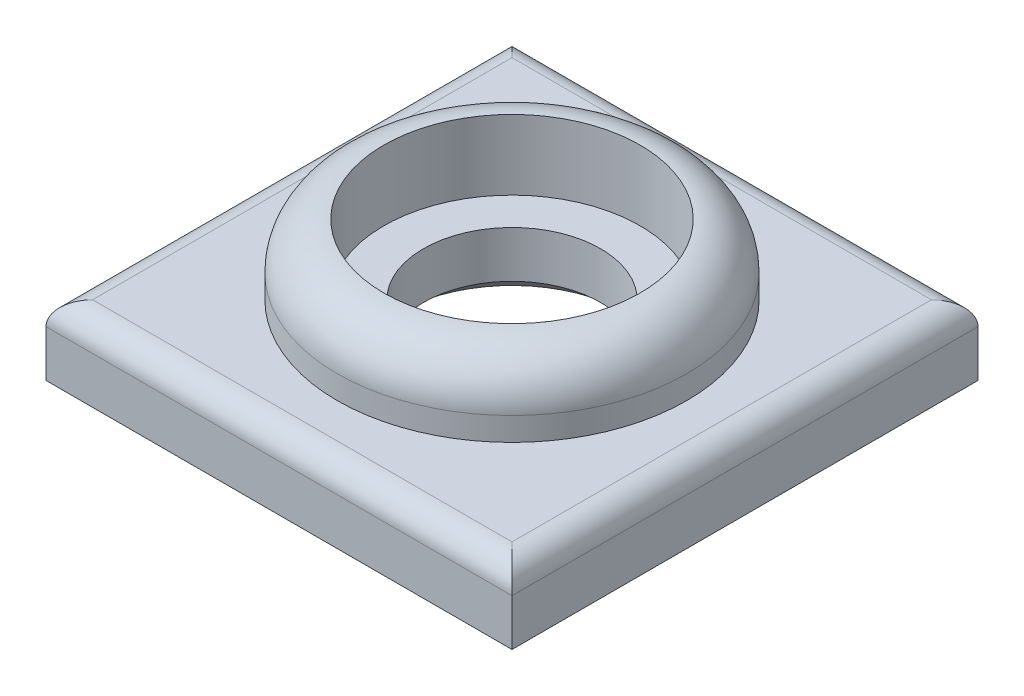
ISO-10303-21;
HEADER;
FILE_DESCRIPTION(('STEP AP214'),'2;1');
FILE_NAME('part.step','',(''),(''),'','','');
FILE_SCHEMA(('AUTOMOTIVE_DESIGN { 1 0 10303 214 1 1 1 1 }'));
ENDSEC;
DATA;
#1=APPLICATION_CONTEXT('core data for automotive mechanical design processes');
#2=APPLICATION_PROTOCOL_DEFINITION('international standard','automotive_design',2000,#1);
#3=PRODUCT_CONTEXT('',#1,'mechanical');
#4=PRODUCT('Part','Part','',(#3));
#5=PRODUCT_RELATED_PRODUCT_CATEGORY('part','',(#4));
#6=PRODUCT_DEFINITION_FORMATION('','',#4);
#7=PRODUCT_DEFINITION_CONTEXT('part definition',#1,'design');
#8=PRODUCT_DEFINITION('design','',#6,#7);
#9=PRODUCT_DEFINITION_SHAPE('','',#8);
#10=(LENGTH_UNIT() NAMED_UNIT(*) SI_UNIT(.MILLI.,.METRE.));
#11=(NAMED_UNIT(*) PLANE_ANGLE_UNIT() SI_UNIT($,.RADIAN.));
#12=(NAMED_UNIT(*) SI_UNIT($,.STERADIAN.) SOLID_ANGLE_UNIT());
#13=UNCERTAINTY_MEASURE_WITH_UNIT(LENGTH_MEASURE(1.E-05),#10,'distance_accuracy_value','');
#14=(GEOMETRIC_REPRESENTATION_CONTEXT(3) GLOBAL_UNCERTAINTY_ASSIGNED_CONTEXT((#13)) GLOBAL_UNIT_ASSIGNED_CONTEXT((#10,
#11,#12)) REPRESENTATION_CONTEXT('',''));
#15=CARTESIAN_POINT('',(0.,0.,0.));
#16=DIRECTION('',(0.,0.,1.));
#17=DIRECTION('',(1.,0.,0.));
#18=AXIS2_PLACEMENT_3D('',#15,#16,#17);
#19=CARTESIAN_POINT('',(0.,3.,0.));
#20=DIRECTION('',(0.,1.,0.));
#21=DIRECTION('',(0.,0.,1.));
#22=AXIS2_PLACEMENT_3D('',#19,#20,#21);
#23=PLANE('',#22);
#24=CARTESIAN_POINT('',(0.,3.,0.));
#25=DIRECTION('',(0.,1.,0.));
#26=DIRECTION('',(0.,0.,1.));
#27=AXIS2_PLACEMENT_3D('',#24,#25,#26);
#28=CIRCLE('',#27,3.8);
#29=CARTESIAN_POINT('',(0.,3.,3.8));
#30=VERTEX_POINT('',#29);
#31=EDGE_CURVE('E113',#30,#30,#28,.T.);
#32=ORIENTED_EDGE('',*,*,#31,.F.);
#33=EDGE_LOOP('',(#32));
#34=FACE_BOUND('',#33,.T.);
#35=CARTESIAN_POINT('',(0.,3.,0.));
#36=DIRECTION('',(0.,1.,0.));
#37=DIRECTION('',(0.,0.,1.));
#38=AXIS2_PLACEMENT_3D('',#35,#36,#37);
#39=CIRCLE('',#38,5.5);
#40=CARTESIAN_POINT('',(0.,3.,5.5));
#41=VERTEX_POINT('',#40);
#42=EDGE_CURVE('E42',#41,#41,#39,.F.);
#43=ORIENTED_EDGE('',*,*,#42,.F.);
#44=EDGE_LOOP('',(#43));
#45=FACE_BOUND('',#44,.T.);
#46=ADVANCED_FACE('F34',(#34,#45),#23,.T.);
#47=CARTESIAN_POINT('',(0.,3.,0.));
#48=DIRECTION('',(0.,1.,0.));
#49=DIRECTION('',(0.,0.,1.));
#50=AXIS2_PLACEMENT_3D('',#47,#48,#49);
#51=CIRCLE('',#50,7.5);
#52=CARTESIAN_POINT('',(0.,3.,7.5));
#53=VERTEX_POINT('',#52);
#54=EDGE_CURVE('E144',#53,#53,#51,.T.);
#55=ORIENTED_EDGE('',*,*,#54,.F.);
#56=EDGE_LOOP('',(#55));
#57=FACE_BOUND('',#56,.T.);
#58=DIRECTION('',(-1.,0.,0.));
#59=VECTOR('',#58,1.);
#60=CARTESIAN_POINT('',(-10.,3.,-9.));
#61=LINE('',#60,#59);
#62=CARTESIAN_POINT('',(9.00000000000001,3.,-9.));
#63=VERTEX_POINT('',#62);
#64=CARTESIAN_POINT('',(-9.,3.,-9.));
#65=VERTEX_POINT('',#64);
#66=EDGE_CURVE('E128',#63,#65,#61,.T.);
#67=ORIENTED_EDGE('',*,*,#66,.T.);
#68=DIRECTION('',(0.,0.,1.));
#69=VECTOR('',#68,1.);
#70=CARTESIAN_POINT('',(-9.,3.,10.));
#71=LINE('',#70,#69);
#72=CARTESIAN_POINT('',(-9.,3.,9.));
#73=VERTEX_POINT('',#72);
#74=EDGE_CURVE('E132',#65,#73,#71,.T.);
#75=ORIENTED_EDGE('',*,*,#74,.T.);
#76=DIRECTION('',(1.,0.,0.));
#77=VECTOR('',#76,1.);
#78=CARTESIAN_POINT('',(10.,3.,9.));
#79=LINE('',#78,#77);
#80=CARTESIAN_POINT('',(9.00000000000001,3.,9.));
#81=VERTEX_POINT('',#80);
#82=EDGE_CURVE('E130',#73,#81,#79,.T.);
#83=ORIENTED_EDGE('',*,*,#82,.T.);
#84=DIRECTION('',(0.,0.,-1.));
#85=VECTOR('',#84,1.);
#86=CARTESIAN_POINT('',(9.00000000000001,3.,-10.));
#87=LINE('',#86,#85);
#88=EDGE_CURVE('E99',#81,#63,#87,.T.);
#89=ORIENTED_EDGE('',*,*,#88,.T.);
#90=EDGE_LOOP('',(#67,#75,#83,#89));
#91=FACE_BOUND('',#90,.T.);
#92=ADVANCED_FACE('F161',(#57,#91),#23,.T.);
#93=CARTESIAN_POINT('',(0.,0.,0.));
#94=DIRECTION('',(0.,1.,0.));
#95=DIRECTION('',(0.,0.,1.));
#96=AXIS2_PLACEMENT_3D('',#93,#94,#95);
#97=PLANE('',#96);
#98=CARTESIAN_POINT('',(0.,0.,0.));
#99=DIRECTION('',(0.,1.,0.));
#100=DIRECTION('',(0.,0.,1.));
#101=AXIS2_PLACEMENT_3D('',#98,#99,#100);
#102=CIRCLE('',#101,4.99175359259421);
#103=CARTESIAN_POINT('',(0.,0.,4.99175359259421));
#104=VERTEX_POINT('',#103);
#105=EDGE_CURVE('E140',#104,#104,#102,.T.);
#106=ORIENTED_EDGE('',*,*,#105,.T.);
#107=EDGE_LOOP('',(#106));
#108=FACE_BOUND('',#107,.T.);
#109=DIRECTION('',(0.,0.,1.));
#110=VECTOR('',#109,1.);
#111=CARTESIAN_POINT('',(-10.,0.,10.));
#112=LINE('',#111,#110);
#113=CARTESIAN_POINT('',(-10.,0.,-10.));
#114=VERTEX_POINT('',#113);
#115=CARTESIAN_POINT('',(-10.,0.,10.));
#116=VERTEX_POINT('',#115);
#117=EDGE_CURVE('E106',#114,#116,#112,.T.);
#118=ORIENTED_EDGE('',*,*,#117,.F.);
#119=DIRECTION('',(-1.,0.,0.));
#120=VECTOR('',#119,1.);
#121=CARTESIAN_POINT('',(10.,0.,-10.));
#122=LINE('',#121,#120);
#123=CARTESIAN_POINT('',(10.,0.,-10.));
#124=VERTEX_POINT('',#123);
#125=EDGE_CURVE('E121',#124,#114,#122,.T.);
#126=ORIENTED_EDGE('',*,*,#125,.F.);
#127=DIRECTION('',(0.,0.,-1.));
#128=VECTOR('',#127,1.);
#129=CARTESIAN_POINT('',(10.,0.,10.));
#130=LINE('',#129,#128);
#131=CARTESIAN_POINT('',(10.,0.,10.));
#132=VERTEX_POINT('',#131);
#133=EDGE_CURVE('E108',#132,#124,#130,.T.);
#134=ORIENTED_EDGE('',*,*,#133,.F.);
#135=DIRECTION('',(1.,0.,0.));
#136=VECTOR('',#135,1.);
#137=CARTESIAN_POINT('',(10.,0.,10.));
#138=LINE('',#137,#136);
#139=EDGE_CURVE('E91',#116,#132,#138,.T.);
#140=ORIENTED_EDGE('',*,*,#139,.F.);
#141=EDGE_LOOP('',(#118,#126,#134,#140));
#142=FACE_BOUND('',#141,.T.);
#143=ADVANCED_FACE('F104',(#108,#142),#97,.F.);
#144=CARTESIAN_POINT('',(-10.,3.,10.));
#145=DIRECTION('',(1.,0.,0.));
#146=DIRECTION('',(0.,0.,-1.));
#147=AXIS2_PLACEMENT_3D('',#144,#145,#146);
#148=PLANE('',#147);
#149=DIRECTION('',(0.,-1.,0.));
#150=VECTOR('',#149,1.);
#151=CARTESIAN_POINT('',(-10.,3.,10.));
#152=LINE('',#151,#150);
#153=CARTESIAN_POINT('',(-10.,2.,10.));
#154=VERTEX_POINT('',#153);
#155=EDGE_CURVE('E88',#154,#116,#152,.T.);
#156=ORIENTED_EDGE('',*,*,#155,.F.);
#157=DIRECTION('',(0.,0.,1.));
#158=VECTOR('',#157,1.);
#159=CARTESIAN_POINT('',(-10.,2.,-10.));
#160=LINE('',#159,#158);
#161=CARTESIAN_POINT('',(-10.,2.,-10.));
#162=VERTEX_POINT('',#161);
#163=EDGE_CURVE('E135',#154,#162,#160,.F.);
#164=ORIENTED_EDGE('',*,*,#163,.T.);
#165=DIRECTION('',(0.,-1.,0.));
#166=VECTOR('',#165,1.);
#167=CARTESIAN_POINT('',(-10.,3.,-10.));
#168=LINE('',#167,#166);
#169=EDGE_CURVE('E111',#162,#114,#168,.T.);
#170=ORIENTED_EDGE('',*,*,#169,.T.);
#171=ORIENTED_EDGE('',*,*,#117,.T.);
#172=EDGE_LOOP('',(#156,#164,#170,#171));
#173=FACE_BOUND('',#172,.T.);
#174=ADVANCED_FACE('F110',(#173),#148,.F.);
#175=CARTESIAN_POINT('',(10.,3.,10.));
#176=DIRECTION('',(0.,0.,-1.));
#177=DIRECTION('',(-1.,0.,0.));
#178=AXIS2_PLACEMENT_3D('',#175,#176,#177);
#179=PLANE('',#178);
#180=DIRECTION('',(0.,-1.,0.));
#181=VECTOR('',#180,1.);
#182=CARTESIAN_POINT('',(10.,3.,10.));
#183=LINE('',#182,#181);
#184=CARTESIAN_POINT('',(10.,2.,10.));
#185=VERTEX_POINT('',#184);
#186=EDGE_CURVE('E100',#185,#132,#183,.T.);
#187=ORIENTED_EDGE('',*,*,#186,.F.);
#188=DIRECTION('',(1.,0.,0.));
#189=VECTOR('',#188,1.);
#190=CARTESIAN_POINT('',(-10.,2.,10.));
#191=LINE('',#190,#189);
#192=EDGE_CURVE('E94',#185,#154,#191,.F.);
#193=ORIENTED_EDGE('',*,*,#192,.T.);
#194=ORIENTED_EDGE('',*,*,#155,.T.);
#195=ORIENTED_EDGE('',*,*,#139,.T.);
#196=EDGE_LOOP('',(#187,#193,#194,#195));
#197=FACE_BOUND('',#196,.T.);
#198=ADVANCED_FACE('F90',(#197),#179,.F.);
#199=CARTESIAN_POINT('',(10.,3.,10.));
#200=DIRECTION('',(-1.,0.,0.));
#201=DIRECTION('',(0.,0.,1.));
#202=AXIS2_PLACEMENT_3D('',#199,#200,#201);
#203=PLANE('',#202);
#204=DIRECTION('',(0.,-1.,0.));
#205=VECTOR('',#204,1.);
#206=CARTESIAN_POINT('',(10.,3.,-10.));
#207=LINE('',#206,#205);
#208=CARTESIAN_POINT('',(10.,2.,-10.));
#209=VERTEX_POINT('',#208);
#210=EDGE_CURVE('E124',#209,#124,#207,.T.);
#211=ORIENTED_EDGE('',*,*,#210,.F.);
#212=DIRECTION('',(0.,0.,-1.));
#213=VECTOR('',#212,1.);
#214=CARTESIAN_POINT('',(10.,2.,10.));
#215=LINE('',#214,#213);
#216=EDGE_CURVE('E56',#209,#185,#215,.F.);
#217=ORIENTED_EDGE('',*,*,#216,.T.);
#218=ORIENTED_EDGE('',*,*,#186,.T.);
#219=ORIENTED_EDGE('',*,*,#133,.T.);
#220=EDGE_LOOP('',(#211,#217,#218,#219));
#221=FACE_BOUND('',#220,.T.);
#222=ADVANCED_FACE('F179',(#221),#203,.F.);
#223=CARTESIAN_POINT('',(10.,3.,-10.));
#224=DIRECTION('',(0.,0.,1.));
#225=DIRECTION('',(1.,0.,0.));
#226=AXIS2_PLACEMENT_3D('',#223,#224,#225);
#227=PLANE('',#226);
#228=ORIENTED_EDGE('',*,*,#169,.F.);
#229=DIRECTION('',(-1.,0.,0.));
#230=VECTOR('',#229,1.);
#231=CARTESIAN_POINT('',(10.,2.,-10.));
#232=LINE('',#231,#230);
#233=EDGE_CURVE('E49',#162,#209,#232,.F.);
#234=ORIENTED_EDGE('',*,*,#233,.T.);
#235=ORIENTED_EDGE('',*,*,#210,.T.);
#236=ORIENTED_EDGE('',*,*,#125,.T.);
#237=EDGE_LOOP('',(#228,#234,#235,#236));
#238=FACE_BOUND('',#237,.T.);
#239=ADVANCED_FACE('F176',(#238),#227,.F.);
#240=CARTESIAN_POINT('',(0.,3.,0.));
#241=DIRECTION('',(0.,-1.,0.));
#242=DIRECTION('',(0.,0.,-1.));
#243=AXIS2_PLACEMENT_3D('',#240,#241,#242);
#244=CYLINDRICAL_SURFACE('',#243,3.8);
#245=CARTESIAN_POINT('',(0.,1.00000000000001,0.));
#246=DIRECTION('',(0.,1.,0.));
#247=DIRECTION('',(0.,0.,1.));
#248=AXIS2_PLACEMENT_3D('',#245,#246,#247);
#249=CIRCLE('',#248,3.8);
#250=CARTESIAN_POINT('',(0.,1.00000000000001,3.8));
#251=VERTEX_POINT('',#250);
#252=EDGE_CURVE('E153',#251,#251,#249,.F.);
#253=ORIENTED_EDGE('',*,*,#252,.T.);
#254=EDGE_LOOP('',(#253));
#255=FACE_BOUND('',#254,.T.);
#256=ORIENTED_EDGE('',*,*,#31,.T.);
#257=EDGE_LOOP('',(#256));
#258=FACE_BOUND('',#257,.T.);
#259=ADVANCED_FACE('F171',(#255,#258),#244,.F.);
#260=CARTESIAN_POINT('',(9.00000000000001,2.,0.));
#261=DIRECTION('',(0.,0.,1.));
#262=DIRECTION('',(1.,0.,0.));
#263=AXIS2_PLACEMENT_3D('',#260,#261,#262);
#264=CYLINDRICAL_SURFACE('',#263,1.);
#265=CARTESIAN_POINT('',(9.00000000000001,2.,9.));
#266=DIRECTION('',(-0.707106781186547,0.,0.707106781186547));
#267=DIRECTION('',(0.707106781186548,0.,0.707106781186547));
#268=AXIS2_PLACEMENT_3D('',#265,#266,#267);
#269=ELLIPSE('',#268,1.41421356237309,1.);
#270=EDGE_CURVE('E146',#185,#81,#269,.T.);
#271=ORIENTED_EDGE('',*,*,#270,.F.);
#272=ORIENTED_EDGE('',*,*,#216,.F.);
#273=CARTESIAN_POINT('',(9.00000000000001,2.,-9.));
#274=DIRECTION('',(0.707106781186548,0.,0.707106781186547));
#275=DIRECTION('',(-0.707106781186547,0.,0.707106781186547));
#276=AXIS2_PLACEMENT_3D('',#273,#274,#275);
#277=ELLIPSE('',#276,1.4142135623731,1.);
#278=EDGE_CURVE('E116',#63,#209,#277,.F.);
#279=ORIENTED_EDGE('',*,*,#278,.F.);
#280=ORIENTED_EDGE('',*,*,#88,.F.);
#281=EDGE_LOOP('',(#271,#272,#279,#280));
#282=FACE_BOUND('',#281,.T.);
#283=ADVANCED_FACE('F198',(#282),#264,.T.);
#284=CARTESIAN_POINT('',(0.,2.,-9.));
#285=DIRECTION('',(1.,0.,0.));
#286=DIRECTION('',(0.,0.,-1.));
#287=AXIS2_PLACEMENT_3D('',#284,#285,#286);
#288=CYLINDRICAL_SURFACE('',#287,1.);
#289=ORIENTED_EDGE('',*,*,#278,.T.);
#290=ORIENTED_EDGE('',*,*,#233,.F.);
#291=CARTESIAN_POINT('',(-9.,2.,-9.));
#292=DIRECTION('',(0.707106781186547,0.,-0.707106781186547));
#293=DIRECTION('',(0.707106781186548,0.,0.707106781186547));
#294=AXIS2_PLACEMENT_3D('',#291,#292,#293);
#295=ELLIPSE('',#294,1.41421356237309,1.);
#296=EDGE_CURVE('E143',#65,#162,#295,.F.);
#297=ORIENTED_EDGE('',*,*,#296,.F.);
#298=ORIENTED_EDGE('',*,*,#66,.F.);
#299=EDGE_LOOP('',(#289,#290,#297,#298));
#300=FACE_BOUND('',#299,.T.);
#301=ADVANCED_FACE('F194',(#300),#288,.T.);
#302=CARTESIAN_POINT('',(0.,2.,9.));
#303=DIRECTION('',(-1.,0.,0.));
#304=DIRECTION('',(0.,0.,1.));
#305=AXIS2_PLACEMENT_3D('',#302,#303,#304);
#306=CYLINDRICAL_SURFACE('',#305,1.);
#307=ORIENTED_EDGE('',*,*,#270,.T.);
#308=ORIENTED_EDGE('',*,*,#82,.F.);
#309=CARTESIAN_POINT('',(-9.,2.,9.));
#310=DIRECTION('',(-0.707106781186548,0.,-0.707106781186547));
#311=DIRECTION('',(-0.707106781186547,0.,0.707106781186547));
#312=AXIS2_PLACEMENT_3D('',#309,#310,#311);
#313=ELLIPSE('',#312,1.4142135623731,1.);
#314=EDGE_CURVE('E141',#154,#73,#313,.T.);
#315=ORIENTED_EDGE('',*,*,#314,.F.);
#316=ORIENTED_EDGE('',*,*,#192,.F.);
#317=EDGE_LOOP('',(#307,#308,#315,#316));
#318=FACE_BOUND('',#317,.T.);
#319=ADVANCED_FACE('F190',(#318),#306,.T.);
#320=CARTESIAN_POINT('',(-9.,2.,0.));
#321=DIRECTION('',(0.,0.,-1.));
#322=DIRECTION('',(-1.,0.,0.));
#323=AXIS2_PLACEMENT_3D('',#320,#321,#322);
#324=CYLINDRICAL_SURFACE('',#323,1.);
#325=ORIENTED_EDGE('',*,*,#296,.T.);
#326=ORIENTED_EDGE('',*,*,#163,.F.);
#327=ORIENTED_EDGE('',*,*,#314,.T.);
#328=ORIENTED_EDGE('',*,*,#74,.F.);
#329=EDGE_LOOP('',(#325,#326,#327,#328));
#330=FACE_BOUND('',#329,.T.);
#331=ADVANCED_FACE('F186',(#330),#324,.T.);
#332=CARTESIAN_POINT('',(0.,0.,0.));
#333=DIRECTION('',(0.,-1.,0.));
#334=DIRECTION('',(0.,0.,-1.));
#335=AXIS2_PLACEMENT_3D('',#332,#333,#334);
#336=CONICAL_SURFACE('',#335,4.99175359259421,0.872664625997163);
#337=ORIENTED_EDGE('',*,*,#252,.F.);
#338=EDGE_LOOP('',(#337));
#339=FACE_BOUND('',#338,.T.);
#340=ORIENTED_EDGE('',*,*,#105,.F.);
#341=EDGE_LOOP('',(#340));
#342=FACE_BOUND('',#341,.T.);
#343=ADVANCED_FACE('F189',(#339,#342),#336,.F.);
#344=CARTESIAN_POINT('',(0.,6.,0.));
#345=DIRECTION('',(0.,-1.,0.));
#346=DIRECTION('',(0.,0.,-1.));
#347=AXIS2_PLACEMENT_3D('',#344,#345,#346);
#348=CYLINDRICAL_SURFACE('',#347,7.5);
#349=CARTESIAN_POINT('',(0.,4.,0.));
#350=DIRECTION('',(0.,1.,0.));
#351=DIRECTION('',(0.,0.,1.));
#352=AXIS2_PLACEMENT_3D('',#349,#350,#351);
#353=CIRCLE('',#352,7.5);
#354=CARTESIAN_POINT('',(0.,4.,7.5));
#355=VERTEX_POINT('',#354);
#356=EDGE_CURVE('E11',#355,#355,#353,.F.);
#357=ORIENTED_EDGE('',*,*,#356,.T.);
#358=EDGE_LOOP('',(#357));
#359=FACE_BOUND('',#358,.T.);
#360=ORIENTED_EDGE('',*,*,#54,.T.);
#361=EDGE_LOOP('',(#360));
#362=FACE_BOUND('',#361,.T.);
#363=ADVANCED_FACE('F203',(#359,#362),#348,.T.);
#364=CARTESIAN_POINT('',(0.,6.,0.));
#365=DIRECTION('',(0.,-1.,0.));
#366=DIRECTION('',(0.,0.,-1.));
#367=AXIS2_PLACEMENT_3D('',#364,#365,#366);
#368=CYLINDRICAL_SURFACE('',#367,5.5);
#369=CARTESIAN_POINT('',(0.,6.,0.));
#370=DIRECTION('',(0.,1.,0.));
#371=DIRECTION('',(0.,0.,1.));
#372=AXIS2_PLACEMENT_3D('',#369,#370,#371);
#373=CIRCLE('',#372,5.5);
#374=CARTESIAN_POINT('',(0.,6.,5.5));
#375=VERTEX_POINT('',#374);
#376=EDGE_CURVE('E311',#375,#375,#373,.T.);
#377=ORIENTED_EDGE('',*,*,#376,.T.);
#378=EDGE_LOOP('',(#377));
#379=FACE_BOUND('',#378,.T.);
#380=ORIENTED_EDGE('',*,*,#42,.T.);
#381=EDGE_LOOP('',(#380));
#382=FACE_BOUND('',#381,.T.);
#383=ADVANCED_FACE('F158',(#379,#382),#368,.F.);
#384=CARTESIAN_POINT('',(0.,4.,0.));
#385=DIRECTION('',(0.,1.,0.));
#386=DIRECTION('',(0.,0.,1.));
#387=AXIS2_PLACEMENT_3D('',#384,#385,#386);
#388=TOROIDAL_SURFACE('',#387,5.5,2.);
#389=ORIENTED_EDGE('',*,*,#356,.F.);
#390=EDGE_LOOP('',(#389));
#391=FACE_BOUND('',#390,.T.);
#392=ORIENTED_EDGE('',*,*,#376,.F.);
#393=EDGE_LOOP('',(#392));
#394=FACE_BOUND('',#393,.T.);
#395=ADVANCED_FACE('F36',(#391,#394),#388,.T.);
#396=CLOSED_SHELL('',(#46,#92,#143,#174,#198,#222,#239,#259,#283,#301,#319,#331,#343,#363,#383,#395));
#397=MANIFOLD_SOLID_BREP('B2',#396);
#398=ADVANCED_BREP_SHAPE_REPRESENTATION('',(#18,#397),#14);
#399=SHAPE_DEFINITION_REPRESENTATION(#9,#398);
ENDSEC;
END-ISO-10303-21;
